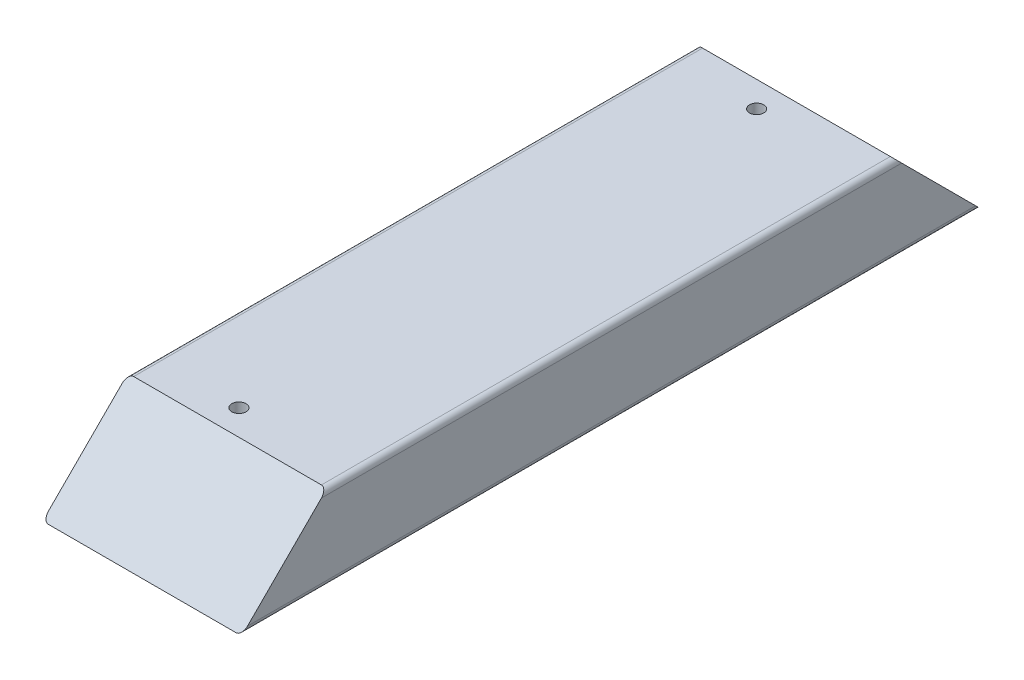
ISO-10303-21;
HEADER;
FILE_DESCRIPTION(('STEP AP214'),'2;1');
FILE_NAME('part.step','',(''),(''),'','','');
FILE_SCHEMA(('AUTOMOTIVE_DESIGN { 1 0 10303 214 1 1 1 1 }'));
ENDSEC;
DATA;
#1=APPLICATION_CONTEXT('core data for automotive mechanical design processes');
#2=APPLICATION_PROTOCOL_DEFINITION('international standard','automotive_design',2000,#1);
#3=PRODUCT_CONTEXT('',#1,'mechanical');
#4=PRODUCT('Part','Part','',(#3));
#5=PRODUCT_RELATED_PRODUCT_CATEGORY('part','',(#4));
#6=PRODUCT_DEFINITION_FORMATION('','',#4);
#7=PRODUCT_DEFINITION_CONTEXT('part definition',#1,'design');
#8=PRODUCT_DEFINITION('design','',#6,#7);
#9=PRODUCT_DEFINITION_SHAPE('','',#8);
#10=(LENGTH_UNIT() NAMED_UNIT(*) SI_UNIT(.MILLI.,.METRE.));
#11=(NAMED_UNIT(*) PLANE_ANGLE_UNIT() SI_UNIT($,.RADIAN.));
#12=(NAMED_UNIT(*) SI_UNIT($,.STERADIAN.) SOLID_ANGLE_UNIT());
#13=UNCERTAINTY_MEASURE_WITH_UNIT(LENGTH_MEASURE(1.E-05),#10,'distance_accuracy_value','');
#14=(GEOMETRIC_REPRESENTATION_CONTEXT(3) GLOBAL_UNCERTAINTY_ASSIGNED_CONTEXT((#13)) GLOBAL_UNIT_ASSIGNED_CONTEXT((#10,
#11,#12)) REPRESENTATION_CONTEXT('',''));
#15=CARTESIAN_POINT('',(0.,0.,0.));
#16=DIRECTION('',(0.,0.,1.));
#17=DIRECTION('',(1.,0.,0.));
#18=AXIS2_PLACEMENT_3D('',#15,#16,#17);
#19=CARTESIAN_POINT('',(44.45,19.05,330.2));
#20=DIRECTION('',(-1.,0.,0.));
#21=DIRECTION('',(0.,-1.,0.));
#22=AXIS2_PLACEMENT_3D('',#19,#20,#21);
#23=PLANE('',#22);
#24=DIRECTION('',(0.,0.707106781186552,-0.707106781186544));
#25=VECTOR('',#24,1.);
#26=CARTESIAN_POINT('',(44.45,2.15105711021124E-13,311.15));
#27=LINE('',#26,#25);
#28=CARTESIAN_POINT('',(44.45,-16.51,327.66));
#29=VERTEX_POINT('',#28);
#30=CARTESIAN_POINT('',(44.45,16.51,294.64));
#31=VERTEX_POINT('',#30);
#32=EDGE_CURVE('E183',#29,#31,#27,.T.);
#33=ORIENTED_EDGE('',*,*,#32,.F.);
#34=DIRECTION('',(0.,0.,-1.));
#35=VECTOR('',#34,1.);
#36=CARTESIAN_POINT('',(44.45,-16.51,330.2));
#37=LINE('',#36,#35);
#38=CARTESIAN_POINT('',(44.45,-16.51,2.53999999999996));
#39=VERTEX_POINT('',#38);
#40=EDGE_CURVE('E121',#29,#39,#37,.T.);
#41=ORIENTED_EDGE('',*,*,#40,.T.);
#42=DIRECTION('',(0.,0.707106781186552,0.707106781186544));
#43=VECTOR('',#42,1.);
#44=CARTESIAN_POINT('',(44.45,165.1,184.149999999998));
#45=LINE('',#44,#43);
#46=CARTESIAN_POINT('',(44.45,16.51,35.5599999999996));
#47=VERTEX_POINT('',#46);
#48=EDGE_CURVE('E181',#39,#47,#45,.T.);
#49=ORIENTED_EDGE('',*,*,#48,.T.);
#50=DIRECTION('',(0.,0.,-1.));
#51=VECTOR('',#50,1.);
#52=CARTESIAN_POINT('',(44.45,16.51,330.2));
#53=LINE('',#52,#51);
#54=EDGE_CURVE('E118',#47,#31,#53,.F.);
#55=ORIENTED_EDGE('',*,*,#54,.T.);
#56=EDGE_LOOP('',(#33,#41,#49,#55));
#57=FACE_BOUND('',#56,.T.);
#58=ADVANCED_FACE('F35',(#57),#23,.F.);
#59=CARTESIAN_POINT('',(-44.45,19.05,330.2));
#60=DIRECTION('',(0.,-1.,0.));
#61=DIRECTION('',(0.,0.,-1.));
#62=AXIS2_PLACEMENT_3D('',#59,#60,#61);
#63=PLANE('',#62);
#64=CARTESIAN_POINT('',(-6.34999999999999,19.05,280.67));
#65=DIRECTION('',(0.,-1.,0.));
#66=DIRECTION('',(0.,0.,-1.));
#67=AXIS2_PLACEMENT_3D('',#64,#65,#66);
#68=CIRCLE('',#67,3.175);
#69=CARTESIAN_POINT('',(-6.34999999999999,19.05,277.495));
#70=VERTEX_POINT('',#69);
#71=EDGE_CURVE('E210',#70,#70,#68,.T.);
#72=ORIENTED_EDGE('',*,*,#71,.T.);
#73=EDGE_LOOP('',(#72));
#74=FACE_BOUND('',#73,.T.);
#75=CARTESIAN_POINT('',(-6.34999999999999,19.05,49.5299999999996));
#76=DIRECTION('',(0.,1.,0.));
#77=DIRECTION('',(0.,0.,1.));
#78=AXIS2_PLACEMENT_3D('',#75,#76,#77);
#79=CIRCLE('',#78,3.175);
#80=CARTESIAN_POINT('',(-6.34999999999999,19.05,52.7049999999996));
#81=VERTEX_POINT('',#80);
#82=EDGE_CURVE('E204',#81,#81,#79,.T.);
#83=ORIENTED_EDGE('',*,*,#82,.F.);
#84=EDGE_LOOP('',(#83));
#85=FACE_BOUND('',#84,.T.);
#86=DIRECTION('',(-1.,0.,0.));
#87=VECTOR('',#86,1.);
#88=CARTESIAN_POINT('',(361.95,19.05,292.1));
#89=LINE('',#88,#87);
#90=CARTESIAN_POINT('',(41.91,19.05,292.1));
#91=VERTEX_POINT('',#90);
#92=CARTESIAN_POINT('',(-41.91,19.05,292.1));
#93=VERTEX_POINT('',#92);
#94=EDGE_CURVE('E50',#91,#93,#89,.T.);
#95=ORIENTED_EDGE('',*,*,#94,.F.);
#96=DIRECTION('',(0.,0.,-1.));
#97=VECTOR('',#96,1.);
#98=CARTESIAN_POINT('',(41.91,19.05,330.2));
#99=LINE('',#98,#97);
#100=CARTESIAN_POINT('',(41.91,19.05,38.0999999999996));
#101=VERTEX_POINT('',#100);
#102=EDGE_CURVE('E130',#91,#101,#99,.T.);
#103=ORIENTED_EDGE('',*,*,#102,.T.);
#104=DIRECTION('',(-1.,0.,0.));
#105=VECTOR('',#104,1.);
#106=CARTESIAN_POINT('',(361.95,19.05,38.0999999999996));
#107=LINE('',#106,#105);
#108=CARTESIAN_POINT('',(-41.91,19.05,38.0999999999996));
#109=VERTEX_POINT('',#108);
#110=EDGE_CURVE('E136',#101,#109,#107,.T.);
#111=ORIENTED_EDGE('',*,*,#110,.T.);
#112=DIRECTION('',(0.,0.,-1.));
#113=VECTOR('',#112,1.);
#114=CARTESIAN_POINT('',(-41.91,19.05,330.2));
#115=LINE('',#114,#113);
#116=EDGE_CURVE('E127',#109,#93,#115,.F.);
#117=ORIENTED_EDGE('',*,*,#116,.T.);
#118=EDGE_LOOP('',(#95,#103,#111,#117));
#119=FACE_BOUND('',#118,.T.);
#120=ADVANCED_FACE('F141',(#74,#85,#119),#63,.F.);
#121=CARTESIAN_POINT('',(-44.45,19.05,330.2));
#122=DIRECTION('',(1.,0.,0.));
#123=DIRECTION('',(0.,0.,-1.));
#124=AXIS2_PLACEMENT_3D('',#121,#122,#123);
#125=PLANE('',#124);
#126=DIRECTION('',(0.,0.707106781186551,-0.707106781186543));
#127=VECTOR('',#126,1.);
#128=CARTESIAN_POINT('',(-44.45,-19.05,330.2));
#129=LINE('',#128,#127);
#130=CARTESIAN_POINT('',(-44.45,-16.51,327.66));
#131=VERTEX_POINT('',#130);
#132=CARTESIAN_POINT('',(-44.45,16.51,294.64));
#133=VERTEX_POINT('',#132);
#134=EDGE_CURVE('E98',#131,#133,#129,.T.);
#135=ORIENTED_EDGE('',*,*,#134,.T.);
#136=DIRECTION('',(0.,0.,-1.));
#137=VECTOR('',#136,1.);
#138=CARTESIAN_POINT('',(-44.45,16.51,330.2));
#139=LINE('',#138,#137);
#140=CARTESIAN_POINT('',(-44.45,16.51,35.5599999999996));
#141=VERTEX_POINT('',#140);
#142=EDGE_CURVE('E57',#133,#141,#139,.T.);
#143=ORIENTED_EDGE('',*,*,#142,.T.);
#144=DIRECTION('',(0.,0.707106781186551,0.707106781186543));
#145=VECTOR('',#144,1.);
#146=CARTESIAN_POINT('',(-44.45,-19.05,0.));
#147=LINE('',#146,#145);
#148=CARTESIAN_POINT('',(-44.45,-16.51,2.53999999999998));
#149=VERTEX_POINT('',#148);
#150=EDGE_CURVE('E114',#149,#141,#147,.T.);
#151=ORIENTED_EDGE('',*,*,#150,.F.);
#152=DIRECTION('',(0.,0.,-1.));
#153=VECTOR('',#152,1.);
#154=CARTESIAN_POINT('',(-44.45,-16.51,330.2));
#155=LINE('',#154,#153);
#156=EDGE_CURVE('E111',#149,#131,#155,.F.);
#157=ORIENTED_EDGE('',*,*,#156,.T.);
#158=EDGE_LOOP('',(#135,#143,#151,#157));
#159=FACE_BOUND('',#158,.T.);
#160=ADVANCED_FACE('F117',(#159),#125,.F.);
#161=CARTESIAN_POINT('',(-41.91,-16.51,330.2));
#162=DIRECTION('',(0.,0.,-1.));
#163=DIRECTION('',(-1.,0.,0.));
#164=AXIS2_PLACEMENT_3D('',#161,#162,#163);
#165=CYLINDRICAL_SURFACE('',#164,2.54);
#166=DIRECTION('',(0.,0.,-1.));
#167=VECTOR('',#166,1.);
#168=CARTESIAN_POINT('',(-41.91,-19.05,330.2));
#169=LINE('',#168,#167);
#170=CARTESIAN_POINT('',(-41.91,-19.05,330.2));
#171=VERTEX_POINT('',#170);
#172=CARTESIAN_POINT('',(-41.91,-19.05,0.));
#173=VERTEX_POINT('',#172);
#174=EDGE_CURVE('E113',#171,#173,#169,.T.);
#175=ORIENTED_EDGE('',*,*,#174,.F.);
#176=CARTESIAN_POINT('',(-41.91,-16.51,327.66));
#177=DIRECTION('',(0.,0.707106781186543,0.707106781186551));
#178=DIRECTION('',(0.,0.707106781186552,-0.707106781186544));
#179=AXIS2_PLACEMENT_3D('',#176,#177,#178);
#180=ELLIPSE('',#179,3.59210244842764,2.54);
#181=EDGE_CURVE('E101',#171,#131,#180,.F.);
#182=ORIENTED_EDGE('',*,*,#181,.T.);
#183=ORIENTED_EDGE('',*,*,#156,.F.);
#184=CARTESIAN_POINT('',(-41.91,-16.51,2.53999999999993));
#185=DIRECTION('',(0.,-0.707106781186543,0.707106781186551));
#186=DIRECTION('',(0.,-0.707106781186552,-0.707106781186544));
#187=AXIS2_PLACEMENT_3D('',#184,#185,#186);
#188=ELLIPSE('',#187,3.59210244842764,2.54);
#189=EDGE_CURVE('E186',#173,#149,#188,.F.);
#190=ORIENTED_EDGE('',*,*,#189,.F.);
#191=EDGE_LOOP('',(#175,#182,#183,#190));
#192=FACE_BOUND('',#191,.T.);
#193=ADVANCED_FACE('F109',(#192),#165,.T.);
#194=CARTESIAN_POINT('',(41.91,-16.51,330.2));
#195=DIRECTION('',(0.,0.,-1.));
#196=DIRECTION('',(-1.,0.,0.));
#197=AXIS2_PLACEMENT_3D('',#194,#195,#196);
#198=CYLINDRICAL_SURFACE('',#197,2.54);
#199=ORIENTED_EDGE('',*,*,#40,.F.);
#200=CARTESIAN_POINT('',(41.91,-16.51,327.66));
#201=DIRECTION('',(0.,0.707106781186543,0.707106781186551));
#202=DIRECTION('',(0.,0.707106781186552,-0.707106781186544));
#203=AXIS2_PLACEMENT_3D('',#200,#201,#202);
#204=ELLIPSE('',#203,3.59210244842764,2.54);
#205=CARTESIAN_POINT('',(41.91,-19.05,330.2));
#206=VERTEX_POINT('',#205);
#207=EDGE_CURVE('E115',#29,#206,#204,.F.);
#208=ORIENTED_EDGE('',*,*,#207,.T.);
#209=DIRECTION('',(0.,0.,-1.));
#210=VECTOR('',#209,1.);
#211=CARTESIAN_POINT('',(41.91,-19.05,330.2));
#212=LINE('',#211,#210);
#213=CARTESIAN_POINT('',(41.91,-19.05,0.));
#214=VERTEX_POINT('',#213);
#215=EDGE_CURVE('E194',#214,#206,#212,.F.);
#216=ORIENTED_EDGE('',*,*,#215,.F.);
#217=CARTESIAN_POINT('',(41.91,-16.51,2.53999999999993));
#218=DIRECTION('',(0.,-0.707106781186543,0.707106781186551));
#219=DIRECTION('',(0.,-0.707106781186552,-0.707106781186544));
#220=AXIS2_PLACEMENT_3D('',#217,#218,#219);
#221=ELLIPSE('',#220,3.59210244842764,2.54);
#222=EDGE_CURVE('E178',#39,#214,#221,.F.);
#223=ORIENTED_EDGE('',*,*,#222,.F.);
#224=EDGE_LOOP('',(#199,#208,#216,#223));
#225=FACE_BOUND('',#224,.T.);
#226=ADVANCED_FACE('F154',(#225),#198,.T.);
#227=CARTESIAN_POINT('',(41.91,16.51,330.2));
#228=DIRECTION('',(0.,0.,-1.));
#229=DIRECTION('',(-1.,0.,0.));
#230=AXIS2_PLACEMENT_3D('',#227,#228,#229);
#231=CYLINDRICAL_SURFACE('',#230,2.54);
#232=ORIENTED_EDGE('',*,*,#102,.F.);
#233=CARTESIAN_POINT('',(41.91,16.51,294.64));
#234=DIRECTION('',(0.,0.707106781186543,0.707106781186551));
#235=DIRECTION('',(0.,0.707106781186552,-0.707106781186544));
#236=AXIS2_PLACEMENT_3D('',#233,#234,#235);
#237=ELLIPSE('',#236,3.59210244842764,2.54);
#238=EDGE_CURVE('E198',#91,#31,#237,.F.);
#239=ORIENTED_EDGE('',*,*,#238,.T.);
#240=ORIENTED_EDGE('',*,*,#54,.F.);
#241=CARTESIAN_POINT('',(41.91,16.51,35.5599999999996));
#242=DIRECTION('',(0.,-0.707106781186543,0.707106781186551));
#243=DIRECTION('',(0.,-0.707106781186552,-0.707106781186544));
#244=AXIS2_PLACEMENT_3D('',#241,#242,#243);
#245=ELLIPSE('',#244,3.59210244842764,2.54);
#246=EDGE_CURVE('E143',#101,#47,#245,.F.);
#247=ORIENTED_EDGE('',*,*,#246,.F.);
#248=EDGE_LOOP('',(#232,#239,#240,#247));
#249=FACE_BOUND('',#248,.T.);
#250=ADVANCED_FACE('F147',(#249),#231,.T.);
#251=CARTESIAN_POINT('',(-41.91,16.51,330.2));
#252=DIRECTION('',(0.,0.,-1.));
#253=DIRECTION('',(-1.,0.,0.));
#254=AXIS2_PLACEMENT_3D('',#251,#252,#253);
#255=CYLINDRICAL_SURFACE('',#254,2.54);
#256=ORIENTED_EDGE('',*,*,#142,.F.);
#257=CARTESIAN_POINT('',(-41.91,16.51,294.64));
#258=DIRECTION('',(0.,0.707106781186543,0.707106781186551));
#259=DIRECTION('',(0.,0.707106781186552,-0.707106781186544));
#260=AXIS2_PLACEMENT_3D('',#257,#258,#259);
#261=ELLIPSE('',#260,3.59210244842764,2.54);
#262=EDGE_CURVE('E11',#133,#93,#261,.F.);
#263=ORIENTED_EDGE('',*,*,#262,.T.);
#264=ORIENTED_EDGE('',*,*,#116,.F.);
#265=CARTESIAN_POINT('',(-41.91,16.51,35.5599999999996));
#266=DIRECTION('',(0.,-0.707106781186543,0.707106781186551));
#267=DIRECTION('',(0.,-0.707106781186552,-0.707106781186544));
#268=AXIS2_PLACEMENT_3D('',#265,#266,#267);
#269=ELLIPSE('',#268,3.59210244842764,2.54);
#270=EDGE_CURVE('E43',#141,#109,#269,.F.);
#271=ORIENTED_EDGE('',*,*,#270,.F.);
#272=EDGE_LOOP('',(#256,#263,#264,#271));
#273=FACE_BOUND('',#272,.T.);
#274=ADVANCED_FACE('F37',(#273),#255,.T.);
#275=CARTESIAN_POINT('',(-44.45,-19.05,330.2));
#276=DIRECTION('',(0.,1.,0.));
#277=DIRECTION('',(0.,0.,1.));
#278=AXIS2_PLACEMENT_3D('',#275,#276,#277);
#279=PLANE('',#278);
#280=DIRECTION('',(1.,0.,0.));
#281=VECTOR('',#280,1.);
#282=CARTESIAN_POINT('',(-44.45,-19.05,330.2));
#283=LINE('',#282,#281);
#284=EDGE_CURVE('E192',#171,#206,#283,.T.);
#285=ORIENTED_EDGE('',*,*,#284,.F.);
#286=ORIENTED_EDGE('',*,*,#174,.T.);
#287=DIRECTION('',(1.,0.,0.));
#288=VECTOR('',#287,1.);
#289=CARTESIAN_POINT('',(-44.45,-19.05,0.));
#290=LINE('',#289,#288);
#291=EDGE_CURVE('E191',#173,#214,#290,.T.);
#292=ORIENTED_EDGE('',*,*,#291,.T.);
#293=ORIENTED_EDGE('',*,*,#215,.T.);
#294=EDGE_LOOP('',(#285,#286,#292,#293));
#295=FACE_BOUND('',#294,.T.);
#296=ADVANCED_FACE('F146',(#295),#279,.F.);
#297=CARTESIAN_POINT('',(361.95,-19.05,0.));
#298=DIRECTION('',(0.,-0.707106781186543,0.707106781186551));
#299=DIRECTION('',(0.,-0.707106781186552,-0.707106781186544));
#300=AXIS2_PLACEMENT_3D('',#297,#298,#299);
#301=PLANE('',#300);
#302=ORIENTED_EDGE('',*,*,#189,.T.);
#303=ORIENTED_EDGE('',*,*,#150,.T.);
#304=ORIENTED_EDGE('',*,*,#270,.T.);
#305=ORIENTED_EDGE('',*,*,#110,.F.);
#306=ORIENTED_EDGE('',*,*,#246,.T.);
#307=ORIENTED_EDGE('',*,*,#48,.F.);
#308=ORIENTED_EDGE('',*,*,#222,.T.);
#309=ORIENTED_EDGE('',*,*,#291,.F.);
#310=EDGE_LOOP('',(#302,#303,#304,#305,#306,#307,#308,#309));
#311=FACE_BOUND('',#310,.T.);
#312=ADVANCED_FACE('F135',(#311),#301,.F.);
#313=CARTESIAN_POINT('',(361.95,-19.05,330.2));
#314=DIRECTION('',(0.,0.707106781186543,0.707106781186551));
#315=DIRECTION('',(0.,-0.707106781186552,0.707106781186544));
#316=AXIS2_PLACEMENT_3D('',#313,#314,#315);
#317=PLANE('',#316);
#318=ORIENTED_EDGE('',*,*,#284,.T.);
#319=ORIENTED_EDGE('',*,*,#207,.F.);
#320=ORIENTED_EDGE('',*,*,#32,.T.);
#321=ORIENTED_EDGE('',*,*,#238,.F.);
#322=ORIENTED_EDGE('',*,*,#94,.T.);
#323=ORIENTED_EDGE('',*,*,#262,.F.);
#324=ORIENTED_EDGE('',*,*,#134,.F.);
#325=ORIENTED_EDGE('',*,*,#181,.F.);
#326=EDGE_LOOP('',(#318,#319,#320,#321,#322,#323,#324,#325));
#327=FACE_BOUND('',#326,.T.);
#328=ADVANCED_FACE('F100',(#327),#317,.T.);
#329=CARTESIAN_POINT('',(-6.34999999999999,6.35,49.5299999999996));
#330=DIRECTION('',(0.,1.,0.));
#331=DIRECTION('',(0.,0.,1.));
#332=AXIS2_PLACEMENT_3D('',#329,#330,#331);
#333=CYLINDRICAL_SURFACE('',#332,3.175);
#334=CARTESIAN_POINT('',(-6.34999999999999,6.35,49.5299999999996));
#335=DIRECTION('',(0.,1.,0.));
#336=DIRECTION('',(0.,0.,1.));
#337=AXIS2_PLACEMENT_3D('',#334,#335,#336);
#338=CIRCLE('',#337,3.175);
#339=CARTESIAN_POINT('',(-6.34999999999999,6.35,52.7049999999996));
#340=VERTEX_POINT('',#339);
#341=EDGE_CURVE('E104',#340,#340,#338,.T.);
#342=ORIENTED_EDGE('',*,*,#341,.F.);
#343=EDGE_LOOP('',(#342));
#344=FACE_BOUND('',#343,.T.);
#345=ORIENTED_EDGE('',*,*,#82,.T.);
#346=EDGE_LOOP('',(#345));
#347=FACE_BOUND('',#346,.T.);
#348=ADVANCED_FACE('F230',(#344,#347),#333,.F.);
#349=CARTESIAN_POINT('',(-6.34999999999999,6.35,49.5299999999996));
#350=DIRECTION('',(0.,1.,0.));
#351=DIRECTION('',(0.,0.,1.));
#352=AXIS2_PLACEMENT_3D('',#349,#350,#351);
#353=PLANE('',#352);
#354=ORIENTED_EDGE('',*,*,#341,.T.);
#355=EDGE_LOOP('',(#354));
#356=FACE_BOUND('',#355,.T.);
#357=ADVANCED_FACE('F225',(#356),#353,.T.);
#358=CARTESIAN_POINT('',(-6.34999999999999,6.35,280.67));
#359=DIRECTION('',(0.,1.,0.));
#360=DIRECTION('',(0.,0.,1.));
#361=AXIS2_PLACEMENT_3D('',#358,#359,#360);
#362=CYLINDRICAL_SURFACE('',#361,3.175);
#363=CARTESIAN_POINT('',(-6.34999999999999,6.35,280.67));
#364=DIRECTION('',(0.,-1.,0.));
#365=DIRECTION('',(0.,0.,-1.));
#366=AXIS2_PLACEMENT_3D('',#363,#364,#365);
#367=CIRCLE('',#366,3.175);
#368=CARTESIAN_POINT('',(-6.34999999999999,6.35,277.495));
#369=VERTEX_POINT('',#368);
#370=EDGE_CURVE('E207',#369,#369,#367,.T.);
#371=ORIENTED_EDGE('',*,*,#370,.T.);
#372=EDGE_LOOP('',(#371));
#373=FACE_BOUND('',#372,.T.);
#374=ORIENTED_EDGE('',*,*,#71,.F.);
#375=EDGE_LOOP('',(#374));
#376=FACE_BOUND('',#375,.T.);
#377=ADVANCED_FACE('F216',(#373,#376),#362,.F.);
#378=CARTESIAN_POINT('',(-6.34999999999999,6.35,280.67));
#379=DIRECTION('',(0.,1.,0.));
#380=DIRECTION('',(0.,0.,-1.));
#381=AXIS2_PLACEMENT_3D('',#378,#379,#380);
#382=PLANE('',#381);
#383=ORIENTED_EDGE('',*,*,#370,.F.);
#384=EDGE_LOOP('',(#383));
#385=FACE_BOUND('',#384,.T.);
#386=ADVANCED_FACE('F219',(#385),#382,.T.);
#387=CLOSED_SHELL('',(#58,#120,#160,#193,#226,#250,#274,#296,#312,#328,#348,#357,#377,#386));
#388=MANIFOLD_SOLID_BREP('B2',#387);
#389=ADVANCED_BREP_SHAPE_REPRESENTATION('',(#18,#388),#14);
#390=SHAPE_DEFINITION_REPRESENTATION(#9,#389);
ENDSEC;
END-ISO-10303-21;
